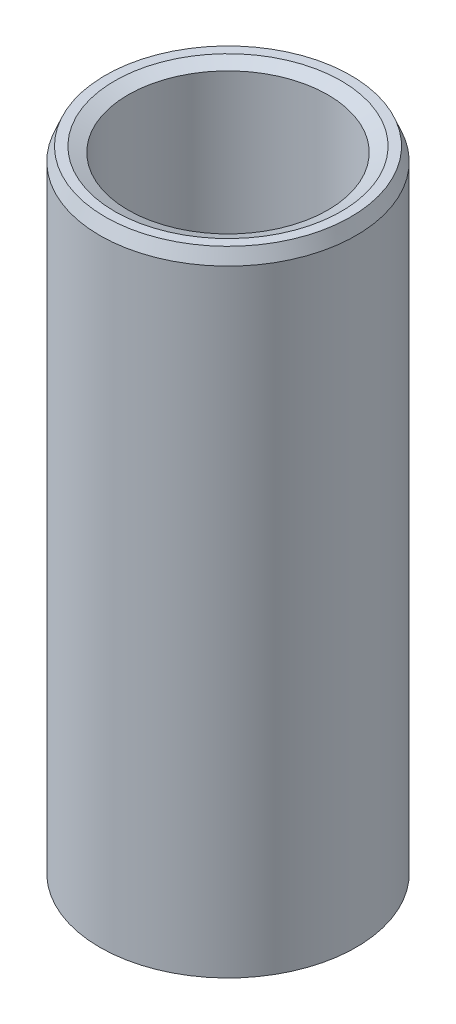
ISO-10303-21;
HEADER;
FILE_DESCRIPTION(('STEP AP214'),'2;1');
FILE_NAME('part.step','',(''),(''),'','','');
FILE_SCHEMA(('AUTOMOTIVE_DESIGN { 1 0 10303 214 1 1 1 1 }'));
ENDSEC;
DATA;
#1=APPLICATION_CONTEXT('core data for automotive mechanical design processes');
#2=APPLICATION_PROTOCOL_DEFINITION('international standard','automotive_design',2000,#1);
#3=PRODUCT_CONTEXT('',#1,'mechanical');
#4=PRODUCT('Part','Part','',(#3));
#5=PRODUCT_RELATED_PRODUCT_CATEGORY('part','',(#4));
#6=PRODUCT_DEFINITION_FORMATION('','',#4);
#7=PRODUCT_DEFINITION_CONTEXT('part definition',#1,'design');
#8=PRODUCT_DEFINITION('design','',#6,#7);
#9=PRODUCT_DEFINITION_SHAPE('','',#8);
#10=(LENGTH_UNIT() NAMED_UNIT(*) SI_UNIT(.MILLI.,.METRE.));
#11=(NAMED_UNIT(*) PLANE_ANGLE_UNIT() SI_UNIT($,.RADIAN.));
#12=(NAMED_UNIT(*) SI_UNIT($,.STERADIAN.) SOLID_ANGLE_UNIT());
#13=UNCERTAINTY_MEASURE_WITH_UNIT(LENGTH_MEASURE(1.E-05),#10,'distance_accuracy_value','');
#14=(GEOMETRIC_REPRESENTATION_CONTEXT(3) GLOBAL_UNCERTAINTY_ASSIGNED_CONTEXT((#13)) GLOBAL_UNIT_ASSIGNED_CONTEXT((#10,
#11,#12)) REPRESENTATION_CONTEXT('',''));
#15=CARTESIAN_POINT('',(0.,0.,0.));
#16=DIRECTION('',(0.,0.,1.));
#17=DIRECTION('',(1.,0.,0.));
#18=AXIS2_PLACEMENT_3D('',#15,#16,#17);
#19=CARTESIAN_POINT('',(0.,173.485702295465,0.));
#20=DIRECTION('',(0.,-1.,0.));
#21=DIRECTION('',(0.,0.,-1.));
#22=AXIS2_PLACEMENT_3D('',#19,#20,#21);
#23=CYLINDRICAL_SURFACE('',#22,35.);
#24=CARTESIAN_POINT('',(0.,1.48521970236876,0.));
#25=DIRECTION('',(0.,1.,0.));
#26=DIRECTION('',(0.,0.,1.));
#27=AXIS2_PLACEMENT_3D('',#24,#25,#26);
#28=CIRCLE('',#27,35.);
#29=CARTESIAN_POINT('',(0.,1.48521970236876,35.));
#30=VERTEX_POINT('',#29);
#31=EDGE_CURVE('E10',#30,#30,#28,.T.);
#32=ORIENTED_EDGE('',*,*,#31,.T.);
#33=EDGE_LOOP('',(#32));
#34=FACE_BOUND('',#33,.T.);
#35=CARTESIAN_POINT('',(0.,169.845144435097,0.));
#36=DIRECTION('',(0.,1.,0.));
#37=DIRECTION('',(0.,0.,1.));
#38=AXIS2_PLACEMENT_3D('',#35,#36,#37);
#39=CIRCLE('',#38,35.);
#40=CARTESIAN_POINT('',(0.,169.845144435097,35.));
#41=VERTEX_POINT('',#40);
#42=EDGE_CURVE('E50',#41,#41,#39,.F.);
#43=ORIENTED_EDGE('',*,*,#42,.T.);
#44=EDGE_LOOP('',(#43));
#45=FACE_BOUND('',#44,.T.);
#46=ADVANCED_FACE('F39',(#34,#45),#23,.T.);
#47=CARTESIAN_POINT('',(0.,173.485702295465,0.));
#48=DIRECTION('',(0.,1.,0.));
#49=DIRECTION('',(0.,0.,1.));
#50=AXIS2_PLACEMENT_3D('',#47,#48,#49);
#51=PLANE('',#50);
#52=CARTESIAN_POINT('',(0.,173.485702295465,0.));
#53=DIRECTION('',(0.,1.,0.));
#54=DIRECTION('',(0.,0.,1.));
#55=AXIS2_PLACEMENT_3D('',#52,#53,#54);
#56=CIRCLE('',#55,30.9202409463706);
#57=CARTESIAN_POINT('',(0.,173.485702295465,30.9202409463706));
#58=VERTEX_POINT('',#57);
#59=EDGE_CURVE('E58',#58,#58,#56,.F.);
#60=ORIENTED_EDGE('',*,*,#59,.T.);
#61=EDGE_LOOP('',(#60));
#62=FACE_BOUND('',#61,.T.);
#63=CARTESIAN_POINT('',(0.,173.485702295465,0.));
#64=DIRECTION('',(0.,1.,0.));
#65=DIRECTION('',(0.,0.,1.));
#66=AXIS2_PLACEMENT_3D('',#63,#64,#65);
#67=CIRCLE('',#66,33.5147802976313);
#68=CARTESIAN_POINT('',(0.,173.485702295465,33.5147802976313));
#69=VERTEX_POINT('',#68);
#70=EDGE_CURVE('E61',#69,#69,#67,.T.);
#71=ORIENTED_EDGE('',*,*,#70,.T.);
#72=EDGE_LOOP('',(#71));
#73=FACE_BOUND('',#72,.T.);
#74=ADVANCED_FACE('F88',(#62,#73),#51,.T.);
#75=CARTESIAN_POINT('',(0.,0.,0.));
#76=DIRECTION('',(0.,1.,0.));
#77=DIRECTION('',(0.,0.,1.));
#78=AXIS2_PLACEMENT_3D('',#75,#76,#77);
#79=PLANE('',#78);
#80=CARTESIAN_POINT('',(0.,0.,0.));
#81=DIRECTION('',(0.,1.,0.));
#82=DIRECTION('',(0.,0.,1.));
#83=AXIS2_PLACEMENT_3D('',#80,#81,#82);
#84=CIRCLE('',#83,28.7649027883708);
#85=CARTESIAN_POINT('',(0.,0.,-28.7649027883708));
#86=VERTEX_POINT('',#85);
#87=EDGE_CURVE('E51',#86,#86,#84,.T.);
#88=ORIENTED_EDGE('',*,*,#87,.T.);
#89=EDGE_LOOP('',(#88));
#90=FACE_BOUND('',#89,.T.);
#91=CARTESIAN_POINT('',(0.,0.,0.));
#92=DIRECTION('',(0.,1.,0.));
#93=DIRECTION('',(0.,0.,1.));
#94=AXIS2_PLACEMENT_3D('',#91,#92,#93);
#95=CIRCLE('',#94,31.3594421396314);
#96=CARTESIAN_POINT('',(0.,0.,31.3594421396314));
#97=VERTEX_POINT('',#96);
#98=EDGE_CURVE('E54',#97,#97,#95,.F.);
#99=ORIENTED_EDGE('',*,*,#98,.T.);
#100=EDGE_LOOP('',(#99));
#101=FACE_BOUND('',#100,.T.);
#102=ADVANCED_FACE('F83',(#90,#101),#79,.F.);
#103=CARTESIAN_POINT('',(0.,173.485702295465,0.));
#104=DIRECTION('',(0.,-1.,0.));
#105=DIRECTION('',(0.,0.,-1.));
#106=AXIS2_PLACEMENT_3D('',#103,#104,#105);
#107=CYLINDRICAL_SURFACE('',#106,27.2796830860021);
#108=CARTESIAN_POINT('',(0.,172.000482593096,0.));
#109=DIRECTION('',(0.,1.,0.));
#110=DIRECTION('',(0.,0.,1.));
#111=AXIS2_PLACEMENT_3D('',#108,#109,#110);
#112=CIRCLE('',#111,27.2796830860021);
#113=CARTESIAN_POINT('',(0.,172.000482593096,27.2796830860021));
#114=VERTEX_POINT('',#113);
#115=EDGE_CURVE('E67',#114,#114,#112,.T.);
#116=ORIENTED_EDGE('',*,*,#115,.T.);
#117=EDGE_LOOP('',(#116));
#118=FACE_BOUND('',#117,.T.);
#119=CARTESIAN_POINT('',(0.,3.64055786036849,0.));
#120=DIRECTION('',(0.,1.,0.));
#121=DIRECTION('',(0.,0.,1.));
#122=AXIS2_PLACEMENT_3D('',#119,#120,#121);
#123=CIRCLE('',#122,27.2796830860021);
#124=CARTESIAN_POINT('',(0.,3.64055786036849,-27.2796830860021));
#125=VERTEX_POINT('',#124);
#126=EDGE_CURVE('E69',#125,#125,#123,.F.);
#127=ORIENTED_EDGE('',*,*,#126,.T.);
#128=EDGE_LOOP('',(#127));
#129=FACE_BOUND('',#128,.T.);
#130=ADVANCED_FACE('F71',(#118,#129),#107,.F.);
#131=CARTESIAN_POINT('',(0.,172.000482593096,0.));
#132=DIRECTION('',(0.,1.,0.));
#133=DIRECTION('',(0.,0.,1.));
#134=AXIS2_PLACEMENT_3D('',#131,#132,#133);
#135=CONICAL_SURFACE('',#134,27.2796830860021,1.18344259885047);
#136=ORIENTED_EDGE('',*,*,#59,.F.);
#137=EDGE_LOOP('',(#136));
#138=FACE_BOUND('',#137,.T.);
#139=ORIENTED_EDGE('',*,*,#115,.F.);
#140=EDGE_LOOP('',(#139));
#141=FACE_BOUND('',#140,.T.);
#142=ADVANCED_FACE('F77',(#138,#141),#135,.F.);
#143=CARTESIAN_POINT('',(0.,0.,0.));
#144=DIRECTION('',(0.,-1.,0.));
#145=DIRECTION('',(0.,0.,-1.));
#146=AXIS2_PLACEMENT_3D('',#143,#144,#145);
#147=CONICAL_SURFACE('',#146,28.7649027883708,0.38735372794443);
#148=CARTESIAN_POINT('',(0.,3.64055786036849,-27.2796830860021));
#149=CARTESIAN_POINT('',(0.,3.60263538265631,-27.2951541245685));
#150=CARTESIAN_POINT('',(0.,3.56471290494414,-27.3106251631348));
#151=CARTESIAN_POINT('',(0.,3.4888679495198,-27.3415672402675));
#152=CARTESIAN_POINT('',(0.,3.45094547180763,-27.3570382788338));
#153=CARTESIAN_POINT('',(0.,3.37510051638328,-27.3879803559665));
#154=CARTESIAN_POINT('',(0.,3.33717803867111,-27.4034513945329));
#155=CARTESIAN_POINT('',(0.,3.26133308324677,-27.4343934716655));
#156=CARTESIAN_POINT('',(0.,3.2234106055346,-27.4498645102319));
#157=CARTESIAN_POINT('',(0.,3.14756565011025,-27.4808065873646));
#158=CARTESIAN_POINT('',(0.,3.10964317239808,-27.4962776259309));
#159=CARTESIAN_POINT('',(0.,3.03379821697374,-27.5272197030636));
#160=CARTESIAN_POINT('',(0.,2.99587573926157,-27.5426907416299));
#161=CARTESIAN_POINT('',(0.,2.92003078383722,-27.5736328187626));
#162=CARTESIAN_POINT('',(0.,2.88210830612505,-27.5891038573289));
#163=CARTESIAN_POINT('',(0.,2.80626335070071,-27.6200459344616));
#164=CARTESIAN_POINT('',(0.,2.76834087298854,-27.635516973028));
#165=CARTESIAN_POINT('',(0.,2.69249591756419,-27.6664590501606));
#166=CARTESIAN_POINT('',(0.,2.65457343985202,-27.681930088727));
#167=CARTESIAN_POINT('',(0.,2.57872848442768,-27.7128721658597));
#168=CARTESIAN_POINT('',(0.,2.54080600671551,-27.728343204426));
#169=CARTESIAN_POINT('',(0.,2.46496105129116,-27.7592852815587));
#170=CARTESIAN_POINT('',(0.,2.42703857357899,-27.774756320125));
#171=CARTESIAN_POINT('',(0.,2.35119361815465,-27.8056983972577));
#172=CARTESIAN_POINT('',(0.,2.31327114044248,-27.8211694358241));
#173=CARTESIAN_POINT('',(0.,2.23742618501813,-27.8521115129567));
#174=CARTESIAN_POINT('',(0.,2.19950370730596,-27.8675825515231));
#175=CARTESIAN_POINT('',(0.,2.12365875188162,-27.8985246286558));
#176=CARTESIAN_POINT('',(0.,2.08573627416945,-27.9139956672221));
#177=CARTESIAN_POINT('',(0.,2.0098913187451,-27.9449377443548));
#178=CARTESIAN_POINT('',(0.,1.97196884103293,-27.9604087829211));
#179=CARTESIAN_POINT('',(0.,1.89612388560859,-27.9913508600538));
#180=CARTESIAN_POINT('',(0.,1.85820140789642,-28.0068218986201));
#181=CARTESIAN_POINT('',(0.,1.78235645247207,-28.0377639757528));
#182=CARTESIAN_POINT('',(0.,1.7444339747599,-28.0532350143192));
#183=CARTESIAN_POINT('',(0.,1.66858901933556,-28.0841770914518));
#184=CARTESIAN_POINT('',(0.,1.63066654162338,-28.0996481300182));
#185=CARTESIAN_POINT('',(0.,1.55482158619904,-28.1305902071509));
#186=CARTESIAN_POINT('',(0.,1.51689910848687,-28.1460612457172));
#187=CARTESIAN_POINT('',(0.,1.44105415306253,-28.1770033228499));
#188=CARTESIAN_POINT('',(0.,1.40313167535035,-28.1924743614162));
#189=CARTESIAN_POINT('',(0.,1.32728671992601,-28.2234164385489));
#190=CARTESIAN_POINT('',(0.,1.28936424221384,-28.2388874771153));
#191=CARTESIAN_POINT('',(0.,1.2135192867895,-28.2698295542479));
#192=CARTESIAN_POINT('',(0.,1.17559680907732,-28.2853005928143));
#193=CARTESIAN_POINT('',(0.,1.09975185365298,-28.316242669947));
#194=CARTESIAN_POINT('',(0.,1.06182937594081,-28.3317137085133));
#195=CARTESIAN_POINT('',(0.,0.985984420516466,-28.362655785646));
#196=CARTESIAN_POINT('',(0.,0.948061942804294,-28.3781268242123));
#197=CARTESIAN_POINT('',(0.,0.87221698737995,-28.409068901345));
#198=CARTESIAN_POINT('',(0.,0.834294509667778,-28.4245399399113));
#199=CARTESIAN_POINT('',(0.,0.758449554243435,-28.455482017044));
#200=CARTESIAN_POINT('',(0.,0.720527076531263,-28.4709530556104));
#201=CARTESIAN_POINT('',(0.,0.64468212110692,-28.501895132743));
#202=CARTESIAN_POINT('',(0.,0.606759643394748,-28.5173661713094));
#203=CARTESIAN_POINT('',(0.,0.530914687970404,-28.5483082484421));
#204=CARTESIAN_POINT('',(0.,0.492992210258232,-28.5637792870084));
#205=CARTESIAN_POINT('',(0.,0.417147254833889,-28.5947213641411));
#206=CARTESIAN_POINT('',(0.,0.379224777121717,-28.6101924027074));
#207=CARTESIAN_POINT('',(0.,0.303379821697374,-28.6411344798401));
#208=CARTESIAN_POINT('',(0.,0.265457343985202,-28.6566055184065));
#209=CARTESIAN_POINT('',(0.,0.189612388560859,-28.6875475955391));
#210=CARTESIAN_POINT('',(0.,0.151689910848687,-28.7030186341055));
#211=CARTESIAN_POINT('',(0.,0.0758449554243435,-28.7339607112382));
#212=CARTESIAN_POINT('',(0.,0.0379224777121718,-28.7494317498045));
#213=CARTESIAN_POINT('',(0.,0.,-28.7649027883708));
#214=B_SPLINE_CURVE_WITH_KNOTS('',3,(#148,#149,#150,#151,#152,#153,#154,#155,#156,#157,#158,
#159,#160,#161,#162,#163,#164,#165,#166,#167,#168,#169,#170,#171,#172,#173,#174,#175,#176,#177,
#178,#179,#180,#181,#182,#183,#184,#185,#186,#187,#188,#189,#190,#191,#192,#193,#194,#195,#196,
#197,#198,#199,#200,#201,#202,#203,#204,#205,#206,#207,#208,#209,#210,#211,#212,#213),
.UNSPECIFIED.,.F.,.F.,(4,2,2,2,2,2,2,2,2,2,2,2,2,2,2,2,2,2,2,2,2,2,2,2,2,2,2,2,2,2,2,2,4),(0.,
0.122870688739676,0.245741377479351,0.368612066219027,0.491482754958704,0.61435344369838,
0.737224132438055,0.860094821177731,0.982965509917407,1.10583619865708,1.22870688739676,
1.35157757613644,1.47444826487611,1.59731895361579,1.72018964235546,1.84306033109514,
1.96593101983481,2.08880170857449,2.21167239731417,2.33454308605384,2.45741377479352,
2.58028446353319,2.70315515227287,2.82602584101255,2.94889652975222,3.0717672184919,
3.19463790723157,3.31750859597125,3.44037928471092,3.5632499734506,3.68612066219028,
3.80899135092995,3.93186203966963),.UNSPECIFIED.);
#215=EDGE_CURVE('BSEAM73',#125,#86,#214,.T.);
#216=ORIENTED_EDGE('',*,*,#126,.F.);
#217=ORIENTED_EDGE('',*,*,#87,.F.);
#218=ORIENTED_EDGE('',*,*,#215,.T.);
#219=ORIENTED_EDGE('',*,*,#215,.F.);
#220=EDGE_LOOP('',(#216,#218,#217,#219));
#221=FACE_BOUND('',#220,.T.);
#222=ADVANCED_FACE('F73',(#221),#147,.F.);
#223=CARTESIAN_POINT('',(0.,1.48521970236876,0.));
#224=DIRECTION('',(0.,1.,0.));
#225=DIRECTION('',(0.,0.,1.));
#226=AXIS2_PLACEMENT_3D('',#223,#224,#225);
#227=CONICAL_SURFACE('',#226,35.,1.18344259885047);
#228=ORIENTED_EDGE('',*,*,#98,.F.);
#229=EDGE_LOOP('',(#228));
#230=FACE_BOUND('',#229,.T.);
#231=ORIENTED_EDGE('',*,*,#31,.F.);
#232=EDGE_LOOP('',(#231));
#233=FACE_BOUND('',#232,.T.);
#234=ADVANCED_FACE('F76',(#230,#233),#227,.T.);
#235=CARTESIAN_POINT('',(0.,173.485702295465,0.));
#236=DIRECTION('',(0.,-1.,0.));
#237=DIRECTION('',(0.,0.,-1.));
#238=AXIS2_PLACEMENT_3D('',#235,#236,#237);
#239=CONICAL_SURFACE('',#238,33.5147802976313,0.38735372794443);
#240=ORIENTED_EDGE('',*,*,#42,.F.);
#241=EDGE_LOOP('',(#240));
#242=FACE_BOUND('',#241,.T.);
#243=ORIENTED_EDGE('',*,*,#70,.F.);
#244=EDGE_LOOP('',(#243));
#245=FACE_BOUND('',#244,.T.);
#246=ADVANCED_FACE('F45',(#242,#245),#239,.T.);
#247=CLOSED_SHELL('',(#46,#74,#102,#130,#142,#222,#234,#246));
#248=MANIFOLD_SOLID_BREP('B2',#247);
#249=ADVANCED_BREP_SHAPE_REPRESENTATION('',(#18,#248),#14);
#250=SHAPE_DEFINITION_REPRESENTATION(#9,#249);
ENDSEC;
END-ISO-10303-21;
